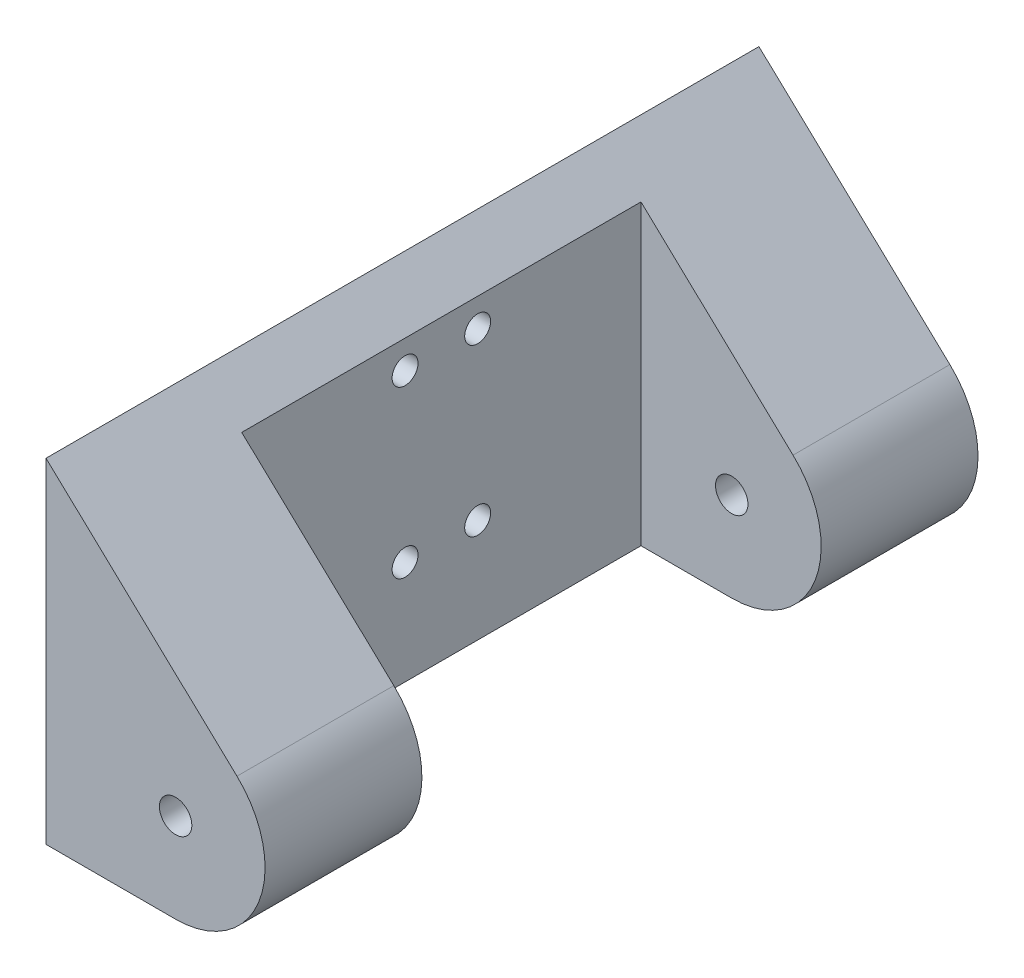
ISO-10303-21;
HEADER;
FILE_DESCRIPTION(('STEP AP214'),'2;1');
FILE_NAME('part.step','',(''),(''),'','','');
FILE_SCHEMA(('AUTOMOTIVE_DESIGN { 1 0 10303 214 1 1 1 1 }'));
ENDSEC;
DATA;
#1=APPLICATION_CONTEXT('core data for automotive mechanical design processes');
#2=APPLICATION_PROTOCOL_DEFINITION('international standard','automotive_design',2000,#1);
#3=PRODUCT_CONTEXT('',#1,'mechanical');
#4=PRODUCT('Part','Part','',(#3));
#5=PRODUCT_RELATED_PRODUCT_CATEGORY('part','',(#4));
#6=PRODUCT_DEFINITION_FORMATION('','',#4);
#7=PRODUCT_DEFINITION_CONTEXT('part definition',#1,'design');
#8=PRODUCT_DEFINITION('design','',#6,#7);
#9=PRODUCT_DEFINITION_SHAPE('','',#8);
#10=(LENGTH_UNIT() NAMED_UNIT(*) SI_UNIT(.MILLI.,.METRE.));
#11=(NAMED_UNIT(*) PLANE_ANGLE_UNIT() SI_UNIT($,.RADIAN.));
#12=(NAMED_UNIT(*) SI_UNIT($,.STERADIAN.) SOLID_ANGLE_UNIT());
#13=UNCERTAINTY_MEASURE_WITH_UNIT(LENGTH_MEASURE(1.E-05),#10,'distance_accuracy_value','');
#14=(GEOMETRIC_REPRESENTATION_CONTEXT(3) GLOBAL_UNCERTAINTY_ASSIGNED_CONTEXT((#13)) GLOBAL_UNIT_ASSIGNED_CONTEXT((#10,
#11,#12)) REPRESENTATION_CONTEXT('',''));
#15=CARTESIAN_POINT('',(0.,0.,0.));
#16=DIRECTION('',(0.,0.,1.));
#17=DIRECTION('',(1.,0.,0.));
#18=AXIS2_PLACEMENT_3D('',#15,#16,#17);
#19=CARTESIAN_POINT('',(45.,5.4,-30.8423410265823));
#20=DIRECTION('',(0.,0.,1.));
#21=DIRECTION('',(1.,0.,0.));
#22=AXIS2_PLACEMENT_3D('',#19,#20,#21);
#23=CYLINDRICAL_SURFACE('',#22,1.25);
#24=CARTESIAN_POINT('',(45.,5.4,42.9));
#25=DIRECTION('',(0.,0.,1.));
#26=DIRECTION('',(1.,0.,0.));
#27=AXIS2_PLACEMENT_3D('',#24,#25,#26);
#28=CIRCLE('',#27,1.25);
#29=CARTESIAN_POINT('',(46.25,5.4,42.9));
#30=VERTEX_POINT('',#29);
#31=EDGE_CURVE('E132',#30,#30,#28,.F.);
#32=ORIENTED_EDGE('',*,*,#31,.T.);
#33=EDGE_LOOP('',(#32));
#34=FACE_BOUND('',#33,.T.);
#35=CARTESIAN_POINT('',(45.,5.4,55.));
#36=DIRECTION('',(0.,0.,1.));
#37=DIRECTION('',(1.,0.,0.));
#38=AXIS2_PLACEMENT_3D('',#35,#36,#37);
#39=CIRCLE('',#38,1.25);
#40=CARTESIAN_POINT('',(46.25,5.4,55.));
#41=VERTEX_POINT('',#40);
#42=EDGE_CURVE('E128',#41,#41,#39,.T.);
#43=ORIENTED_EDGE('',*,*,#42,.T.);
#44=EDGE_LOOP('',(#43));
#45=FACE_BOUND('',#44,.T.);
#46=ADVANCED_FACE('F33',(#34,#45),#23,.F.);
#47=CARTESIAN_POINT('',(45.,5.4,-30.8423410265823));
#48=DIRECTION('',(0.,0.,1.));
#49=DIRECTION('',(1.,0.,0.));
#50=AXIS2_PLACEMENT_3D('',#47,#48,#49);
#51=CYLINDRICAL_SURFACE('',#50,6.9);
#52=CARTESIAN_POINT('',(45.,5.4,42.9));
#53=DIRECTION('',(0.,0.,1.));
#54=DIRECTION('',(1.,0.,0.));
#55=AXIS2_PLACEMENT_3D('',#52,#53,#54);
#56=CIRCLE('',#55,6.9);
#57=CARTESIAN_POINT('',(49.7313331507193,10.4223984924441,42.9));
#58=VERTEX_POINT('',#57);
#59=CARTESIAN_POINT('',(45.,-1.5,42.9));
#60=VERTEX_POINT('',#59);
#61=EDGE_CURVE('E11',#58,#60,#56,.F.);
#62=ORIENTED_EDGE('',*,*,#61,.F.);
#63=DIRECTION('',(0.,0.,1.));
#64=VECTOR('',#63,1.);
#65=CARTESIAN_POINT('',(49.7313331507193,10.4223984924441,-30.8423410265823));
#66=LINE('',#65,#64);
#67=CARTESIAN_POINT('',(49.7313331507193,10.4223984924441,55.));
#68=VERTEX_POINT('',#67);
#69=EDGE_CURVE('E139',#58,#68,#66,.T.);
#70=ORIENTED_EDGE('',*,*,#69,.T.);
#71=CARTESIAN_POINT('',(45.,5.4,55.));
#72=DIRECTION('',(0.,0.,1.));
#73=DIRECTION('',(1.,0.,0.));
#74=AXIS2_PLACEMENT_3D('',#71,#72,#73);
#75=CIRCLE('',#74,6.9);
#76=CARTESIAN_POINT('',(45.,-1.5,55.));
#77=VERTEX_POINT('',#76);
#78=EDGE_CURVE('E131',#77,#68,#75,.T.);
#79=ORIENTED_EDGE('',*,*,#78,.F.);
#80=DIRECTION('',(0.,0.,1.));
#81=VECTOR('',#80,1.);
#82=CARTESIAN_POINT('',(45.,-1.5,-30.8423410265823));
#83=LINE('',#82,#81);
#84=EDGE_CURVE('E137',#60,#77,#83,.T.);
#85=ORIENTED_EDGE('',*,*,#84,.F.);
#86=EDGE_LOOP('',(#62,#70,#79,#85));
#87=FACE_BOUND('',#86,.T.);
#88=ADVANCED_FACE('F156',(#87),#51,.T.);
#89=CARTESIAN_POINT('',(-35.,-1.5,55.));
#90=DIRECTION('',(0.,1.,0.));
#91=DIRECTION('',(0.,0.,1.));
#92=AXIS2_PLACEMENT_3D('',#89,#90,#91);
#93=PLANE('',#92);
#94=DIRECTION('',(1.,0.,0.));
#95=VECTOR('',#94,1.);
#96=CARTESIAN_POINT('',(-35.,-1.5,55.));
#97=LINE('',#96,#95);
#98=CARTESIAN_POINT('',(35.,-1.5,55.));
#99=VERTEX_POINT('',#98);
#100=EDGE_CURVE('E42',#99,#77,#97,.T.);
#101=ORIENTED_EDGE('',*,*,#100,.F.);
#102=DIRECTION('',(0.,0.,-1.));
#103=VECTOR('',#102,1.);
#104=CARTESIAN_POINT('',(35.,-1.5,55.));
#105=LINE('',#104,#103);
#106=CARTESIAN_POINT('',(35.,-1.5,0.));
#107=VERTEX_POINT('',#106);
#108=EDGE_CURVE('E113',#99,#107,#105,.T.);
#109=ORIENTED_EDGE('',*,*,#108,.T.);
#110=DIRECTION('',(1.,0.,0.));
#111=VECTOR('',#110,1.);
#112=CARTESIAN_POINT('',(-35.,-1.5,0.));
#113=LINE('',#112,#111);
#114=CARTESIAN_POINT('',(45.,-1.5,0.));
#115=VERTEX_POINT('',#114);
#116=EDGE_CURVE('E57',#107,#115,#113,.T.);
#117=ORIENTED_EDGE('',*,*,#116,.T.);
#118=CARTESIAN_POINT('',(45.,-1.5,12.1));
#119=VERTEX_POINT('',#118);
#120=EDGE_CURVE('E140',#115,#119,#83,.T.);
#121=ORIENTED_EDGE('',*,*,#120,.T.);
#122=DIRECTION('',(1.,0.,0.));
#123=VECTOR('',#122,1.);
#124=CARTESIAN_POINT('',(35.,-1.5,12.1));
#125=LINE('',#124,#123);
#126=CARTESIAN_POINT('',(38.,-1.5,12.1));
#127=VERTEX_POINT('',#126);
#128=EDGE_CURVE('E176',#127,#119,#125,.T.);
#129=ORIENTED_EDGE('',*,*,#128,.F.);
#130=DIRECTION('',(0.,0.,-1.));
#131=VECTOR('',#130,1.);
#132=CARTESIAN_POINT('',(38.,-1.5,42.9));
#133=LINE('',#132,#131);
#134=CARTESIAN_POINT('',(38.,-1.5,42.9));
#135=VERTEX_POINT('',#134);
#136=EDGE_CURVE('E180',#135,#127,#133,.T.);
#137=ORIENTED_EDGE('',*,*,#136,.F.);
#138=DIRECTION('',(-1.,0.,0.));
#139=VECTOR('',#138,1.);
#140=CARTESIAN_POINT('',(35.,-1.5,42.9));
#141=LINE('',#140,#139);
#142=EDGE_CURVE('E153',#60,#135,#141,.T.);
#143=ORIENTED_EDGE('',*,*,#142,.F.);
#144=ORIENTED_EDGE('',*,*,#84,.T.);
#145=EDGE_LOOP('',(#101,#109,#117,#121,#129,#137,#143,#144));
#146=FACE_BOUND('',#145,.T.);
#147=ADVANCED_FACE('F35',(#146),#93,.F.);
#148=CARTESIAN_POINT('',(0.,0.,55.));
#149=DIRECTION('',(0.,0.,1.));
#150=DIRECTION('',(1.,0.,0.));
#151=AXIS2_PLACEMENT_3D('',#148,#149,#150);
#152=PLANE('',#151);
#153=DIRECTION('',(0.,1.,0.));
#154=VECTOR('',#153,1.);
#155=CARTESIAN_POINT('',(35.,-71.7,55.));
#156=LINE('',#155,#154);
#157=CARTESIAN_POINT('',(35.,24.3,55.));
#158=VERTEX_POINT('',#157);
#159=EDGE_CURVE('E105',#99,#158,#156,.T.);
#160=ORIENTED_EDGE('',*,*,#159,.F.);
#161=ORIENTED_EDGE('',*,*,#100,.T.);
#162=ORIENTED_EDGE('',*,*,#78,.T.);
#163=DIRECTION('',(-0.727883839484649,0.685700456625986,0.));
#164=VECTOR('',#163,1.);
#165=CARTESIAN_POINT('',(35.,24.3,55.));
#166=LINE('',#165,#164);
#167=EDGE_CURVE('E135',#68,#158,#166,.T.);
#168=ORIENTED_EDGE('',*,*,#167,.T.);
#169=EDGE_LOOP('',(#160,#161,#162,#168));
#170=FACE_BOUND('',#169,.T.);
#171=ORIENTED_EDGE('',*,*,#42,.F.);
#172=EDGE_LOOP('',(#171));
#173=FACE_BOUND('',#172,.T.);
#174=ADVANCED_FACE('F146',(#170,#173),#152,.T.);
#175=CARTESIAN_POINT('',(0.,0.,0.));
#176=DIRECTION('',(0.,0.,1.));
#177=DIRECTION('',(1.,0.,0.));
#178=AXIS2_PLACEMENT_3D('',#175,#176,#177);
#179=PLANE('',#178);
#180=ORIENTED_EDGE('',*,*,#116,.F.);
#181=DIRECTION('',(0.,1.,0.));
#182=VECTOR('',#181,1.);
#183=CARTESIAN_POINT('',(35.,0.,0.));
#184=LINE('',#183,#182);
#185=CARTESIAN_POINT('',(35.,24.3,0.));
#186=VERTEX_POINT('',#185);
#187=EDGE_CURVE('E103',#107,#186,#184,.T.);
#188=ORIENTED_EDGE('',*,*,#187,.T.);
#189=DIRECTION('',(0.727883839484649,-0.685700456625986,0.));
#190=VECTOR('',#189,1.);
#191=CARTESIAN_POINT('',(35.,24.3,0.));
#192=LINE('',#191,#190);
#193=CARTESIAN_POINT('',(49.7313331507193,10.4223984924441,0.));
#194=VERTEX_POINT('',#193);
#195=EDGE_CURVE('E49',#186,#194,#192,.T.);
#196=ORIENTED_EDGE('',*,*,#195,.T.);
#197=CARTESIAN_POINT('',(45.,5.4,0.));
#198=DIRECTION('',(0.,0.,1.));
#199=DIRECTION('',(1.,0.,0.));
#200=AXIS2_PLACEMENT_3D('',#197,#198,#199);
#201=CIRCLE('',#200,6.9);
#202=EDGE_CURVE('E121',#194,#115,#201,.F.);
#203=ORIENTED_EDGE('',*,*,#202,.T.);
#204=EDGE_LOOP('',(#180,#188,#196,#203));
#205=FACE_BOUND('',#204,.T.);
#206=CARTESIAN_POINT('',(45.,5.4,0.));
#207=DIRECTION('',(0.,0.,1.));
#208=DIRECTION('',(1.,0.,0.));
#209=AXIS2_PLACEMENT_3D('',#206,#207,#208);
#210=CIRCLE('',#209,1.25);
#211=CARTESIAN_POINT('',(46.25,5.4,0.));
#212=VERTEX_POINT('',#211);
#213=EDGE_CURVE('E109',#212,#212,#210,.F.);
#214=ORIENTED_EDGE('',*,*,#213,.F.);
#215=EDGE_LOOP('',(#214));
#216=FACE_BOUND('',#215,.T.);
#217=ADVANCED_FACE('F111',(#205,#216),#179,.F.);
#218=CARTESIAN_POINT('',(27.,19.3,24.7));
#219=DIRECTION('',(1.,0.,0.));
#220=DIRECTION('',(0.,0.,-1.));
#221=AXIS2_PLACEMENT_3D('',#218,#219,#220);
#222=CYLINDRICAL_SURFACE('',#221,1.);
#223=CARTESIAN_POINT('',(35.,19.3,24.7));
#224=DIRECTION('',(1.,0.,0.));
#225=DIRECTION('',(0.,0.,-1.));
#226=AXIS2_PLACEMENT_3D('',#223,#224,#225);
#227=CIRCLE('',#226,1.);
#228=CARTESIAN_POINT('',(35.,19.3,23.7));
#229=VERTEX_POINT('',#228);
#230=EDGE_CURVE('E114',#229,#229,#227,.T.);
#231=ORIENTED_EDGE('',*,*,#230,.F.);
#232=EDGE_LOOP('',(#231));
#233=FACE_BOUND('',#232,.T.);
#234=CARTESIAN_POINT('',(38.,19.3,24.7));
#235=DIRECTION('',(1.,0.,0.));
#236=DIRECTION('',(0.,0.,-1.));
#237=AXIS2_PLACEMENT_3D('',#234,#235,#236);
#238=CIRCLE('',#237,1.);
#239=CARTESIAN_POINT('',(38.,19.3,23.7));
#240=VERTEX_POINT('',#239);
#241=EDGE_CURVE('E193',#240,#240,#238,.T.);
#242=ORIENTED_EDGE('',*,*,#241,.T.);
#243=EDGE_LOOP('',(#242));
#244=FACE_BOUND('',#243,.T.);
#245=ADVANCED_FACE('F225',(#233,#244),#222,.F.);
#246=CARTESIAN_POINT('',(27.,19.3,30.3));
#247=DIRECTION('',(1.,0.,0.));
#248=DIRECTION('',(0.,0.,-1.));
#249=AXIS2_PLACEMENT_3D('',#246,#247,#248);
#250=CYLINDRICAL_SURFACE('',#249,1.);
#251=CARTESIAN_POINT('',(35.,19.3,30.3));
#252=DIRECTION('',(1.,0.,0.));
#253=DIRECTION('',(0.,0.,-1.));
#254=AXIS2_PLACEMENT_3D('',#251,#252,#253);
#255=CIRCLE('',#254,1.);
#256=CARTESIAN_POINT('',(35.,19.3,29.3));
#257=VERTEX_POINT('',#256);
#258=EDGE_CURVE('E200',#257,#257,#255,.F.);
#259=ORIENTED_EDGE('',*,*,#258,.T.);
#260=EDGE_LOOP('',(#259));
#261=FACE_BOUND('',#260,.T.);
#262=CARTESIAN_POINT('',(38.,19.3,30.3));
#263=DIRECTION('',(1.,0.,0.));
#264=DIRECTION('',(0.,0.,-1.));
#265=AXIS2_PLACEMENT_3D('',#262,#263,#264);
#266=CIRCLE('',#265,1.);
#267=CARTESIAN_POINT('',(38.,19.3,29.3));
#268=VERTEX_POINT('',#267);
#269=EDGE_CURVE('E184',#268,#268,#266,.T.);
#270=ORIENTED_EDGE('',*,*,#269,.T.);
#271=EDGE_LOOP('',(#270));
#272=FACE_BOUND('',#271,.T.);
#273=ADVANCED_FACE('F221',(#261,#272),#250,.F.);
#274=CARTESIAN_POINT('',(45.,5.4,12.1));
#275=DIRECTION('',(0.,0.,-1.));
#276=DIRECTION('',(-1.,0.,0.));
#277=AXIS2_PLACEMENT_3D('',#274,#275,#276);
#278=CIRCLE('',#277,1.25);
#279=CARTESIAN_POINT('',(43.75,5.4,12.1));
#280=VERTEX_POINT('',#279);
#281=EDGE_CURVE('E164',#280,#280,#278,.F.);
#282=ORIENTED_EDGE('',*,*,#281,.T.);
#283=EDGE_LOOP('',(#282));
#284=FACE_BOUND('',#283,.T.);
#285=ORIENTED_EDGE('',*,*,#213,.T.);
#286=EDGE_LOOP('',(#285));
#287=FACE_BOUND('',#286,.T.);
#288=ADVANCED_FACE('F224',(#284,#287),#23,.F.);
#289=CARTESIAN_POINT('',(35.,24.3,-30.8423410265823));
#290=DIRECTION('',(0.685700456625986,0.727883839484649,0.));
#291=DIRECTION('',(-0.727883839484649,0.685700456625986,0.));
#292=AXIS2_PLACEMENT_3D('',#289,#290,#291);
#293=PLANE('',#292);
#294=CARTESIAN_POINT('',(49.7313331507193,10.4223984924441,12.1));
#295=VERTEX_POINT('',#294);
#296=EDGE_CURVE('E120',#194,#295,#66,.T.);
#297=ORIENTED_EDGE('',*,*,#296,.F.);
#298=ORIENTED_EDGE('',*,*,#195,.F.);
#299=DIRECTION('',(0.,0.,-1.));
#300=VECTOR('',#299,1.);
#301=CARTESIAN_POINT('',(35.,24.3,0.));
#302=LINE('',#301,#300);
#303=EDGE_CURVE('E100',#158,#186,#302,.T.);
#304=ORIENTED_EDGE('',*,*,#303,.F.);
#305=ORIENTED_EDGE('',*,*,#167,.F.);
#306=ORIENTED_EDGE('',*,*,#69,.F.);
#307=DIRECTION('',(0.727883839484649,-0.685700456625986,0.));
#308=VECTOR('',#307,1.);
#309=CARTESIAN_POINT('',(35.,24.3,42.9));
#310=LINE('',#309,#308);
#311=CARTESIAN_POINT('',(38.,21.4738603630293,42.9));
#312=VERTEX_POINT('',#311);
#313=EDGE_CURVE('E159',#312,#58,#310,.T.);
#314=ORIENTED_EDGE('',*,*,#313,.F.);
#315=DIRECTION('',(0.,0.,-1.));
#316=VECTOR('',#315,1.);
#317=CARTESIAN_POINT('',(38.,21.4738603630293,96.));
#318=LINE('',#317,#316);
#319=CARTESIAN_POINT('',(38.,21.4738603630293,12.1));
#320=VERTEX_POINT('',#319);
#321=EDGE_CURVE('E160',#312,#320,#318,.T.);
#322=ORIENTED_EDGE('',*,*,#321,.T.);
#323=DIRECTION('',(-0.727883839484649,0.685700456625986,0.));
#324=VECTOR('',#323,1.);
#325=CARTESIAN_POINT('',(35.,24.3,12.1));
#326=LINE('',#325,#324);
#327=EDGE_CURVE('E168',#295,#320,#326,.T.);
#328=ORIENTED_EDGE('',*,*,#327,.F.);
#329=EDGE_LOOP('',(#297,#298,#304,#305,#306,#314,#322,#328));
#330=FACE_BOUND('',#329,.T.);
#331=ADVANCED_FACE('F117',(#330),#293,.T.);
#332=CARTESIAN_POINT('',(45.,5.4,12.1));
#333=DIRECTION('',(0.,0.,-1.));
#334=DIRECTION('',(-1.,0.,0.));
#335=AXIS2_PLACEMENT_3D('',#332,#333,#334);
#336=CIRCLE('',#335,6.9);
#337=EDGE_CURVE('E173',#119,#295,#336,.F.);
#338=ORIENTED_EDGE('',*,*,#337,.F.);
#339=ORIENTED_EDGE('',*,*,#120,.F.);
#340=ORIENTED_EDGE('',*,*,#202,.F.);
#341=ORIENTED_EDGE('',*,*,#296,.T.);
#342=EDGE_LOOP('',(#338,#339,#340,#341));
#343=FACE_BOUND('',#342,.T.);
#344=ADVANCED_FACE('F215',(#343),#51,.T.);
#345=CARTESIAN_POINT('',(35.,24.3,-30.8423410265823));
#346=DIRECTION('',(-1.,0.,0.));
#347=DIRECTION('',(0.,0.,1.));
#348=AXIS2_PLACEMENT_3D('',#345,#346,#347);
#349=PLANE('',#348);
#350=ORIENTED_EDGE('',*,*,#159,.T.);
#351=ORIENTED_EDGE('',*,*,#303,.T.);
#352=ORIENTED_EDGE('',*,*,#187,.F.);
#353=ORIENTED_EDGE('',*,*,#108,.F.);
#354=EDGE_LOOP('',(#350,#351,#352,#353));
#355=FACE_BOUND('',#354,.T.);
#356=ORIENTED_EDGE('',*,*,#230,.T.);
#357=EDGE_LOOP('',(#356));
#358=FACE_BOUND('',#357,.T.);
#359=CARTESIAN_POINT('',(35.,6.5,30.3));
#360=DIRECTION('',(1.,0.,0.));
#361=DIRECTION('',(0.,0.,-1.));
#362=AXIS2_PLACEMENT_3D('',#359,#360,#361);
#363=CIRCLE('',#362,1.);
#364=CARTESIAN_POINT('',(35.,6.5,29.3));
#365=VERTEX_POINT('',#364);
#366=EDGE_CURVE('E37',#365,#365,#363,.F.);
#367=ORIENTED_EDGE('',*,*,#366,.F.);
#368=EDGE_LOOP('',(#367));
#369=FACE_BOUND('',#368,.T.);
#370=CARTESIAN_POINT('',(35.,6.5,24.7));
#371=DIRECTION('',(1.,0.,0.));
#372=DIRECTION('',(0.,0.,-1.));
#373=AXIS2_PLACEMENT_3D('',#370,#371,#372);
#374=CIRCLE('',#373,1.);
#375=CARTESIAN_POINT('',(35.,6.5,23.7));
#376=VERTEX_POINT('',#375);
#377=EDGE_CURVE('E203',#376,#376,#374,.T.);
#378=ORIENTED_EDGE('',*,*,#377,.T.);
#379=EDGE_LOOP('',(#378));
#380=FACE_BOUND('',#379,.T.);
#381=ORIENTED_EDGE('',*,*,#258,.F.);
#382=EDGE_LOOP('',(#381));
#383=FACE_BOUND('',#382,.T.);
#384=ADVANCED_FACE('F101',(#355,#358,#369,#380,#383),#349,.T.);
#385=CARTESIAN_POINT('',(35.,33.5,42.9));
#386=DIRECTION('',(0.,0.,1.));
#387=DIRECTION('',(1.,0.,0.));
#388=AXIS2_PLACEMENT_3D('',#385,#386,#387);
#389=PLANE('',#388);
#390=ORIENTED_EDGE('',*,*,#142,.T.);
#391=DIRECTION('',(0.,-1.,0.));
#392=VECTOR('',#391,1.);
#393=CARTESIAN_POINT('',(38.,24.3,42.9));
#394=LINE('',#393,#392);
#395=EDGE_CURVE('E182',#312,#135,#394,.T.);
#396=ORIENTED_EDGE('',*,*,#395,.F.);
#397=ORIENTED_EDGE('',*,*,#313,.T.);
#398=ORIENTED_EDGE('',*,*,#61,.T.);
#399=EDGE_LOOP('',(#390,#396,#397,#398));
#400=FACE_BOUND('',#399,.T.);
#401=ORIENTED_EDGE('',*,*,#31,.F.);
#402=EDGE_LOOP('',(#401));
#403=FACE_BOUND('',#402,.T.);
#404=ADVANCED_FACE('F214',(#400,#403),#389,.F.);
#405=CARTESIAN_POINT('',(35.,33.5,12.1));
#406=DIRECTION('',(0.,0.,-1.));
#407=DIRECTION('',(-1.,0.,0.));
#408=AXIS2_PLACEMENT_3D('',#405,#406,#407);
#409=PLANE('',#408);
#410=ORIENTED_EDGE('',*,*,#327,.T.);
#411=DIRECTION('',(0.,1.,0.));
#412=VECTOR('',#411,1.);
#413=CARTESIAN_POINT('',(38.,24.3,12.1));
#414=LINE('',#413,#412);
#415=EDGE_CURVE('E178',#127,#320,#414,.T.);
#416=ORIENTED_EDGE('',*,*,#415,.F.);
#417=ORIENTED_EDGE('',*,*,#128,.T.);
#418=ORIENTED_EDGE('',*,*,#337,.T.);
#419=EDGE_LOOP('',(#410,#416,#417,#418));
#420=FACE_BOUND('',#419,.T.);
#421=ORIENTED_EDGE('',*,*,#281,.F.);
#422=EDGE_LOOP('',(#421));
#423=FACE_BOUND('',#422,.T.);
#424=ADVANCED_FACE('F233',(#420,#423),#409,.F.);
#425=CARTESIAN_POINT('',(38.,0.,0.));
#426=DIRECTION('',(1.,0.,0.));
#427=DIRECTION('',(0.,0.,-1.));
#428=AXIS2_PLACEMENT_3D('',#425,#426,#427);
#429=PLANE('',#428);
#430=ORIENTED_EDGE('',*,*,#321,.F.);
#431=ORIENTED_EDGE('',*,*,#395,.T.);
#432=ORIENTED_EDGE('',*,*,#136,.T.);
#433=ORIENTED_EDGE('',*,*,#415,.T.);
#434=EDGE_LOOP('',(#430,#431,#432,#433));
#435=FACE_BOUND('',#434,.T.);
#436=CARTESIAN_POINT('',(38.,6.5,24.7));
#437=DIRECTION('',(1.,0.,0.));
#438=DIRECTION('',(0.,0.,-1.));
#439=AXIS2_PLACEMENT_3D('',#436,#437,#438);
#440=CIRCLE('',#439,1.);
#441=CARTESIAN_POINT('',(38.,6.5,23.7));
#442=VERTEX_POINT('',#441);
#443=EDGE_CURVE('E190',#442,#442,#440,.T.);
#444=ORIENTED_EDGE('',*,*,#443,.F.);
#445=EDGE_LOOP('',(#444));
#446=FACE_BOUND('',#445,.T.);
#447=ORIENTED_EDGE('',*,*,#269,.F.);
#448=EDGE_LOOP('',(#447));
#449=FACE_BOUND('',#448,.T.);
#450=CARTESIAN_POINT('',(38.,6.5,30.3));
#451=DIRECTION('',(1.,0.,0.));
#452=DIRECTION('',(0.,0.,-1.));
#453=AXIS2_PLACEMENT_3D('',#450,#451,#452);
#454=CIRCLE('',#453,1.00000000000001);
#455=CARTESIAN_POINT('',(38.,6.5,29.3));
#456=VERTEX_POINT('',#455);
#457=EDGE_CURVE('E187',#456,#456,#454,.T.);
#458=ORIENTED_EDGE('',*,*,#457,.F.);
#459=EDGE_LOOP('',(#458));
#460=FACE_BOUND('',#459,.T.);
#461=ORIENTED_EDGE('',*,*,#241,.F.);
#462=EDGE_LOOP('',(#461));
#463=FACE_BOUND('',#462,.T.);
#464=ADVANCED_FACE('F229',(#435,#446,#449,#460,#463),#429,.T.);
#465=CARTESIAN_POINT('',(27.,6.5,24.7));
#466=DIRECTION('',(1.,0.,0.));
#467=DIRECTION('',(0.,0.,-1.));
#468=AXIS2_PLACEMENT_3D('',#465,#466,#467);
#469=CYLINDRICAL_SURFACE('',#468,1.);
#470=ORIENTED_EDGE('',*,*,#377,.F.);
#471=EDGE_LOOP('',(#470));
#472=FACE_BOUND('',#471,.T.);
#473=ORIENTED_EDGE('',*,*,#443,.T.);
#474=EDGE_LOOP('',(#473));
#475=FACE_BOUND('',#474,.T.);
#476=ADVANCED_FACE('F232',(#472,#475),#469,.F.);
#477=CARTESIAN_POINT('',(27.,6.5,30.3));
#478=DIRECTION('',(1.,0.,0.));
#479=DIRECTION('',(0.,0.,-1.));
#480=AXIS2_PLACEMENT_3D('',#477,#478,#479);
#481=CYLINDRICAL_SURFACE('',#480,1.);
#482=ORIENTED_EDGE('',*,*,#366,.T.);
#483=EDGE_LOOP('',(#482));
#484=FACE_BOUND('',#483,.T.);
#485=ORIENTED_EDGE('',*,*,#457,.T.);
#486=EDGE_LOOP('',(#485));
#487=FACE_BOUND('',#486,.T.);
#488=ADVANCED_FACE('F209',(#484,#487),#481,.F.);
#489=CLOSED_SHELL('',(#46,#88,#147,#174,#217,#245,#273,#288,#331,#344,#384,#404,#424,#464,#476,#488));
#490=MANIFOLD_SOLID_BREP('B2',#489);
#491=ADVANCED_BREP_SHAPE_REPRESENTATION('',(#18,#490),#14);
#492=SHAPE_DEFINITION_REPRESENTATION(#9,#491);
ENDSEC;
END-ISO-10303-21;
